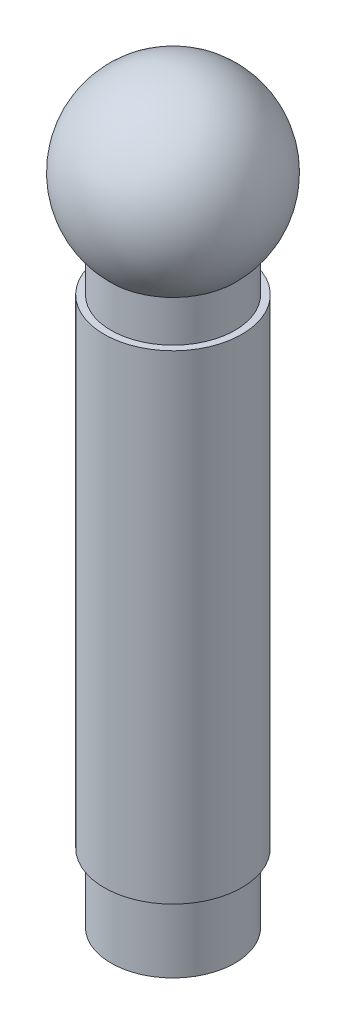
ISO-10303-21;
HEADER;
FILE_DESCRIPTION(('STEP AP214'),'2;1');
FILE_NAME('part.step','',(''),(''),'','','');
FILE_SCHEMA(('AUTOMOTIVE_DESIGN { 1 0 10303 214 1 1 1 1 }'));
ENDSEC;
DATA;
#1=APPLICATION_CONTEXT('core data for automotive mechanical design processes');
#2=APPLICATION_PROTOCOL_DEFINITION('international standard','automotive_design',2000,#1);
#3=PRODUCT_CONTEXT('',#1,'mechanical');
#4=PRODUCT('Part','Part','',(#3));
#5=PRODUCT_RELATED_PRODUCT_CATEGORY('part','',(#4));
#6=PRODUCT_DEFINITION_FORMATION('','',#4);
#7=PRODUCT_DEFINITION_CONTEXT('part definition',#1,'design');
#8=PRODUCT_DEFINITION('design','',#6,#7);
#9=PRODUCT_DEFINITION_SHAPE('','',#8);
#10=(LENGTH_UNIT() NAMED_UNIT(*) SI_UNIT(.MILLI.,.METRE.));
#11=(NAMED_UNIT(*) PLANE_ANGLE_UNIT() SI_UNIT($,.RADIAN.));
#12=(NAMED_UNIT(*) SI_UNIT($,.STERADIAN.) SOLID_ANGLE_UNIT());
#13=UNCERTAINTY_MEASURE_WITH_UNIT(LENGTH_MEASURE(1.E-05),#10,'distance_accuracy_value','');
#14=(GEOMETRIC_REPRESENTATION_CONTEXT(3) GLOBAL_UNCERTAINTY_ASSIGNED_CONTEXT((#13)) GLOBAL_UNIT_ASSIGNED_CONTEXT((#10,
#11,#12)) REPRESENTATION_CONTEXT('',''));
#15=CARTESIAN_POINT('',(0.,0.,0.));
#16=DIRECTION('',(0.,0.,1.));
#17=DIRECTION('',(1.,0.,0.));
#18=AXIS2_PLACEMENT_3D('',#15,#16,#17);
#19=CARTESIAN_POINT('',(5.00000000000001,-112.929313236621,0.));
#20=DIRECTION('',(0.,-1.,0.));
#21=DIRECTION('',(0.,0.,-1.));
#22=AXIS2_PLACEMENT_3D('',#19,#20,#21);
#23=PLANE('',#22);
#24=CARTESIAN_POINT('',(0.,-112.929313236621,0.));
#25=DIRECTION('',(0.,-1.,0.));
#26=DIRECTION('',(0.,0.,-1.));
#27=AXIS2_PLACEMENT_3D('',#24,#25,#26);
#28=CIRCLE('',#27,5.00000000000001);
#29=CARTESIAN_POINT('',(0.,-112.929313236621,-5.00000000000001));
#30=VERTEX_POINT('',#29);
#31=EDGE_CURVE('E11',#30,#30,#28,.T.);
#32=ORIENTED_EDGE('',*,*,#31,.T.);
#33=EDGE_LOOP('',(#32));
#34=FACE_BOUND('',#33,.T.);
#35=CARTESIAN_POINT('',(0.,-112.929313236621,0.));
#36=DIRECTION('',(0.,-1.,0.));
#37=DIRECTION('',(0.,0.,-1.));
#38=AXIS2_PLACEMENT_3D('',#35,#36,#37);
#39=CIRCLE('',#38,4.50000000000001);
#40=CARTESIAN_POINT('',(0.,-112.929313236621,-4.50000000000001));
#41=VERTEX_POINT('',#40);
#42=EDGE_CURVE('E111',#41,#41,#39,.T.);
#43=ORIENTED_EDGE('',*,*,#42,.F.);
#44=EDGE_LOOP('',(#43));
#45=FACE_BOUND('',#44,.T.);
#46=ADVANCED_FACE('F36',(#34,#45),#23,.T.);
#47=CARTESIAN_POINT('',(0.,-29.8745348837209,0.));
#48=DIRECTION('',(0.,-1.,0.));
#49=DIRECTION('',(0.,0.,-1.));
#50=AXIS2_PLACEMENT_3D('',#47,#48,#49);
#51=CYLINDRICAL_SURFACE('',#50,5.00000000000001);
#52=CARTESIAN_POINT('',(0.,-78.1197289964447,0.));
#53=DIRECTION('',(0.,-1.,0.));
#54=DIRECTION('',(0.,0.,-1.));
#55=AXIS2_PLACEMENT_3D('',#52,#53,#54);
#56=CIRCLE('',#55,5.);
#57=CARTESIAN_POINT('',(0.,-78.1197289964447,-5.));
#58=VERTEX_POINT('',#57);
#59=EDGE_CURVE('E43',#58,#58,#56,.T.);
#60=ORIENTED_EDGE('',*,*,#59,.T.);
#61=EDGE_LOOP('',(#60));
#62=FACE_BOUND('',#61,.T.);
#63=ORIENTED_EDGE('',*,*,#31,.F.);
#64=EDGE_LOOP('',(#63));
#65=FACE_BOUND('',#64,.T.);
#66=ADVANCED_FACE('F127',(#62,#65),#51,.T.);
#67=CARTESIAN_POINT('',(4.5,-78.1197289964447,0.));
#68=DIRECTION('',(0.,1.,0.));
#69=DIRECTION('',(0.,0.,1.));
#70=AXIS2_PLACEMENT_3D('',#67,#68,#69);
#71=PLANE('',#70);
#72=CARTESIAN_POINT('',(0.,-78.1197289964447,0.));
#73=DIRECTION('',(0.,-1.,0.));
#74=DIRECTION('',(0.,0.,-1.));
#75=AXIS2_PLACEMENT_3D('',#72,#73,#74);
#76=CIRCLE('',#75,4.5);
#77=CARTESIAN_POINT('',(0.,-78.1197289964447,-4.5));
#78=VERTEX_POINT('',#77);
#79=EDGE_CURVE('E122',#78,#78,#76,.T.);
#80=ORIENTED_EDGE('',*,*,#79,.T.);
#81=EDGE_LOOP('',(#80));
#82=FACE_BOUND('',#81,.T.);
#83=ORIENTED_EDGE('',*,*,#59,.F.);
#84=EDGE_LOOP('',(#83));
#85=FACE_BOUND('',#84,.T.);
#86=ADVANCED_FACE('F130',(#82,#85),#71,.T.);
#87=CARTESIAN_POINT('',(0.,-29.8745348837209,0.));
#88=DIRECTION('',(0.,-1.,0.));
#89=DIRECTION('',(0.,0.,-1.));
#90=AXIS2_PLACEMENT_3D('',#87,#88,#89);
#91=CYLINDRICAL_SURFACE('',#90,4.5);
#92=CARTESIAN_POINT('',(0.,-75.1197289964447,0.));
#93=DIRECTION('',(0.,-1.,0.));
#94=DIRECTION('',(0.,0.,-1.));
#95=AXIS2_PLACEMENT_3D('',#92,#93,#94);
#96=CIRCLE('',#95,4.5);
#97=CARTESIAN_POINT('',(0.,-75.1197289964447,-4.5));
#98=VERTEX_POINT('',#97);
#99=EDGE_CURVE('E119',#98,#98,#96,.T.);
#100=ORIENTED_EDGE('',*,*,#99,.T.);
#101=EDGE_LOOP('',(#100));
#102=FACE_BOUND('',#101,.T.);
#103=ORIENTED_EDGE('',*,*,#79,.F.);
#104=EDGE_LOOP('',(#103));
#105=FACE_BOUND('',#104,.T.);
#106=ADVANCED_FACE('F132',(#102,#105),#91,.T.);
#107=CARTESIAN_POINT('',(0.,-70.4293132366212,0.));
#108=DIRECTION('',(0.,-1.,0.));
#109=DIRECTION('',(1.,0.,0.));
#110=AXIS2_PLACEMENT_3D('',#107,#108,#109);
#111=SPHERICAL_SURFACE('',#110,6.5);
#112=ORIENTED_EDGE('',*,*,#99,.F.);
#113=EDGE_LOOP('',(#112));
#114=FACE_BOUND('',#113,.T.);
#115=ADVANCED_FACE('F139',(#114),#111,.T.);
#116=CARTESIAN_POINT('',(4.5,-117.929313236621,0.));
#117=DIRECTION('',(0.,-1.,0.));
#118=DIRECTION('',(0.,0.,-1.));
#119=AXIS2_PLACEMENT_3D('',#116,#117,#118);
#120=PLANE('',#119);
#121=DIRECTION('',(0.,0.,-1.));
#122=VECTOR('',#121,1.);
#123=CARTESIAN_POINT('',(-2.5,-117.929313236621,1.));
#124=LINE('',#123,#122);
#125=CARTESIAN_POINT('',(-2.5,-117.929313236621,1.));
#126=VERTEX_POINT('',#125);
#127=CARTESIAN_POINT('',(-2.5,-117.929313236621,-1.));
#128=VERTEX_POINT('',#127);
#129=EDGE_CURVE('E50',#126,#128,#124,.T.);
#130=ORIENTED_EDGE('',*,*,#129,.F.);
#131=DIRECTION('',(-1.,0.,0.));
#132=VECTOR('',#131,1.);
#133=CARTESIAN_POINT('',(-2.5,-117.929313236621,1.));
#134=LINE('',#133,#132);
#135=CARTESIAN_POINT('',(2.5,-117.929313236621,1.));
#136=VERTEX_POINT('',#135);
#137=EDGE_CURVE('E101',#136,#126,#134,.T.);
#138=ORIENTED_EDGE('',*,*,#137,.F.);
#139=DIRECTION('',(0.,0.,1.));
#140=VECTOR('',#139,1.);
#141=CARTESIAN_POINT('',(2.5,-117.929313236621,1.));
#142=LINE('',#141,#140);
#143=CARTESIAN_POINT('',(2.5,-117.929313236621,-0.999999999999999));
#144=VERTEX_POINT('',#143);
#145=EDGE_CURVE('E107',#144,#136,#142,.T.);
#146=ORIENTED_EDGE('',*,*,#145,.F.);
#147=DIRECTION('',(1.,0.,0.));
#148=VECTOR('',#147,1.);
#149=CARTESIAN_POINT('',(-2.5,-117.929313236621,-1.));
#150=LINE('',#149,#148);
#151=EDGE_CURVE('E85',#128,#144,#150,.T.);
#152=ORIENTED_EDGE('',*,*,#151,.F.);
#153=EDGE_LOOP('',(#130,#138,#146,#152));
#154=FACE_BOUND('',#153,.T.);
#155=CARTESIAN_POINT('',(0.,-117.929313236621,0.));
#156=DIRECTION('',(0.,-1.,0.));
#157=DIRECTION('',(0.,0.,-1.));
#158=AXIS2_PLACEMENT_3D('',#155,#156,#157);
#159=CIRCLE('',#158,4.5);
#160=CARTESIAN_POINT('',(0.,-117.929313236621,-4.5));
#161=VERTEX_POINT('',#160);
#162=EDGE_CURVE('E116',#161,#161,#159,.T.);
#163=ORIENTED_EDGE('',*,*,#162,.T.);
#164=EDGE_LOOP('',(#163));
#165=FACE_BOUND('',#164,.T.);
#166=ADVANCED_FACE('F154',(#154,#165),#120,.T.);
#167=CARTESIAN_POINT('',(0.,-29.8745348837209,0.));
#168=DIRECTION('',(0.,-1.,0.));
#169=DIRECTION('',(0.,0.,-1.));
#170=AXIS2_PLACEMENT_3D('',#167,#168,#169);
#171=CYLINDRICAL_SURFACE('',#170,4.50000000000001);
#172=ORIENTED_EDGE('',*,*,#42,.T.);
#173=EDGE_LOOP('',(#172));
#174=FACE_BOUND('',#173,.T.);
#175=ORIENTED_EDGE('',*,*,#162,.F.);
#176=EDGE_LOOP('',(#175));
#177=FACE_BOUND('',#176,.T.);
#178=ADVANCED_FACE('F150',(#174,#177),#171,.T.);
#179=CARTESIAN_POINT('',(-2.5,-107.929313236621,1.));
#180=DIRECTION('',(-1.,0.,0.));
#181=DIRECTION('',(0.,0.,1.));
#182=AXIS2_PLACEMENT_3D('',#179,#180,#181);
#183=PLANE('',#182);
#184=ORIENTED_EDGE('',*,*,#129,.T.);
#185=DIRECTION('',(0.,-1.,0.));
#186=VECTOR('',#185,1.);
#187=CARTESIAN_POINT('',(-2.5,-107.929313236621,-1.));
#188=LINE('',#187,#186);
#189=CARTESIAN_POINT('',(-2.5,-107.929313236621,-1.));
#190=VERTEX_POINT('',#189);
#191=EDGE_CURVE('E73',#190,#128,#188,.T.);
#192=ORIENTED_EDGE('',*,*,#191,.F.);
#193=DIRECTION('',(0.,0.,-1.));
#194=VECTOR('',#193,1.);
#195=CARTESIAN_POINT('',(-2.5,-107.929313236621,1.));
#196=LINE('',#195,#194);
#197=CARTESIAN_POINT('',(-2.5,-107.929313236621,1.));
#198=VERTEX_POINT('',#197);
#199=EDGE_CURVE('E99',#198,#190,#196,.T.);
#200=ORIENTED_EDGE('',*,*,#199,.F.);
#201=DIRECTION('',(0.,-1.,0.));
#202=VECTOR('',#201,1.);
#203=CARTESIAN_POINT('',(-2.5,-107.929313236621,1.));
#204=LINE('',#203,#202);
#205=EDGE_CURVE('E58',#198,#126,#204,.T.);
#206=ORIENTED_EDGE('',*,*,#205,.T.);
#207=EDGE_LOOP('',(#184,#192,#200,#206));
#208=FACE_BOUND('',#207,.T.);
#209=ADVANCED_FACE('F153',(#208),#183,.F.);
#210=CARTESIAN_POINT('',(-2.5,-107.929313236621,1.));
#211=DIRECTION('',(0.,0.,1.));
#212=DIRECTION('',(1.,0.,0.));
#213=AXIS2_PLACEMENT_3D('',#210,#211,#212);
#214=PLANE('',#213);
#215=ORIENTED_EDGE('',*,*,#137,.T.);
#216=ORIENTED_EDGE('',*,*,#205,.F.);
#217=DIRECTION('',(-1.,0.,0.));
#218=VECTOR('',#217,1.);
#219=CARTESIAN_POINT('',(-2.5,-107.929313236621,1.));
#220=LINE('',#219,#218);
#221=CARTESIAN_POINT('',(2.5,-107.929313236621,1.));
#222=VERTEX_POINT('',#221);
#223=EDGE_CURVE('E96',#222,#198,#220,.T.);
#224=ORIENTED_EDGE('',*,*,#223,.F.);
#225=DIRECTION('',(0.,-1.,0.));
#226=VECTOR('',#225,1.);
#227=CARTESIAN_POINT('',(2.5,-107.929313236621,1.));
#228=LINE('',#227,#226);
#229=EDGE_CURVE('E89',#222,#136,#228,.T.);
#230=ORIENTED_EDGE('',*,*,#229,.T.);
#231=EDGE_LOOP('',(#215,#216,#224,#230));
#232=FACE_BOUND('',#231,.T.);
#233=ADVANCED_FACE('F169',(#232),#214,.F.);
#234=CARTESIAN_POINT('',(2.5,-107.929313236621,1.));
#235=DIRECTION('',(1.,0.,0.));
#236=DIRECTION('',(0.,0.,-1.));
#237=AXIS2_PLACEMENT_3D('',#234,#235,#236);
#238=PLANE('',#237);
#239=ORIENTED_EDGE('',*,*,#145,.T.);
#240=ORIENTED_EDGE('',*,*,#229,.F.);
#241=DIRECTION('',(0.,0.,1.));
#242=VECTOR('',#241,1.);
#243=CARTESIAN_POINT('',(2.5,-107.929313236621,1.));
#244=LINE('',#243,#242);
#245=CARTESIAN_POINT('',(2.5,-107.929313236621,-0.999999999999999));
#246=VERTEX_POINT('',#245);
#247=EDGE_CURVE('E92',#246,#222,#244,.T.);
#248=ORIENTED_EDGE('',*,*,#247,.F.);
#249=DIRECTION('',(0.,-1.,0.));
#250=VECTOR('',#249,1.);
#251=CARTESIAN_POINT('',(2.5,-107.929313236621,-0.999999999999999));
#252=LINE('',#251,#250);
#253=EDGE_CURVE('E78',#246,#144,#252,.T.);
#254=ORIENTED_EDGE('',*,*,#253,.T.);
#255=EDGE_LOOP('',(#239,#240,#248,#254));
#256=FACE_BOUND('',#255,.T.);
#257=ADVANCED_FACE('F93',(#256),#238,.F.);
#258=CARTESIAN_POINT('',(-2.5,-107.929313236621,-1.));
#259=DIRECTION('',(0.,0.,-1.));
#260=DIRECTION('',(-1.,0.,0.));
#261=AXIS2_PLACEMENT_3D('',#258,#259,#260);
#262=PLANE('',#261);
#263=ORIENTED_EDGE('',*,*,#151,.T.);
#264=ORIENTED_EDGE('',*,*,#253,.F.);
#265=DIRECTION('',(1.,0.,0.));
#266=VECTOR('',#265,1.);
#267=CARTESIAN_POINT('',(-2.5,-107.929313236621,-1.));
#268=LINE('',#267,#266);
#269=EDGE_CURVE('E82',#190,#246,#268,.T.);
#270=ORIENTED_EDGE('',*,*,#269,.F.);
#271=ORIENTED_EDGE('',*,*,#191,.T.);
#272=EDGE_LOOP('',(#263,#264,#270,#271));
#273=FACE_BOUND('',#272,.T.);
#274=ADVANCED_FACE('F80',(#273),#262,.F.);
#275=CARTESIAN_POINT('',(0.,-107.929313236621,0.));
#276=DIRECTION('',(0.,-1.,0.));
#277=DIRECTION('',(0.,0.,-1.));
#278=AXIS2_PLACEMENT_3D('',#275,#276,#277);
#279=PLANE('',#278);
#280=ORIENTED_EDGE('',*,*,#199,.T.);
#281=ORIENTED_EDGE('',*,*,#269,.T.);
#282=ORIENTED_EDGE('',*,*,#247,.T.);
#283=ORIENTED_EDGE('',*,*,#223,.T.);
#284=EDGE_LOOP('',(#280,#281,#282,#283));
#285=FACE_BOUND('',#284,.T.);
#286=ADVANCED_FACE('F98',(#285),#279,.T.);
#287=CLOSED_SHELL('',(#46,#66,#86,#106,#115,#166,#178,#209,#233,#257,#274,#286));
#288=MANIFOLD_SOLID_BREP('B2',#287);
#289=ADVANCED_BREP_SHAPE_REPRESENTATION('',(#18,#288),#14);
#290=SHAPE_DEFINITION_REPRESENTATION(#9,#289);
ENDSEC;
END-ISO-10303-21;
